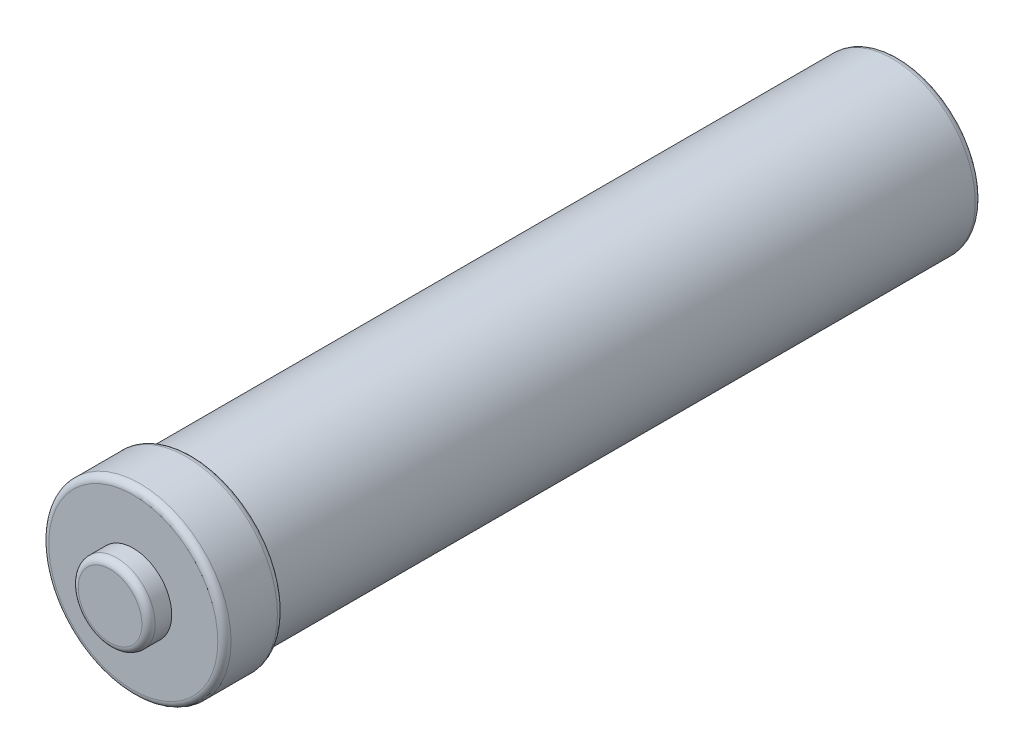
ISO-10303-21;
HEADER;
FILE_DESCRIPTION(('STEP AP214'),'2;1');
FILE_NAME('part.step','',(''),(''),'','','');
FILE_SCHEMA(('AUTOMOTIVE_DESIGN { 1 0 10303 214 1 1 1 1 }'));
ENDSEC;
DATA;
#1=APPLICATION_CONTEXT('core data for automotive mechanical design processes');
#2=APPLICATION_PROTOCOL_DEFINITION('international standard','automotive_design',2000,#1);
#3=PRODUCT_CONTEXT('',#1,'mechanical');
#4=PRODUCT('Part','Part','',(#3));
#5=PRODUCT_RELATED_PRODUCT_CATEGORY('part','',(#4));
#6=PRODUCT_DEFINITION_FORMATION('','',#4);
#7=PRODUCT_DEFINITION_CONTEXT('part definition',#1,'design');
#8=PRODUCT_DEFINITION('design','',#6,#7);
#9=PRODUCT_DEFINITION_SHAPE('','',#8);
#10=(LENGTH_UNIT() NAMED_UNIT(*) SI_UNIT(.MILLI.,.METRE.));
#11=(NAMED_UNIT(*) PLANE_ANGLE_UNIT() SI_UNIT($,.RADIAN.));
#12=(NAMED_UNIT(*) SI_UNIT($,.STERADIAN.) SOLID_ANGLE_UNIT());
#13=UNCERTAINTY_MEASURE_WITH_UNIT(LENGTH_MEASURE(1.E-05),#10,'distance_accuracy_value','');
#14=(GEOMETRIC_REPRESENTATION_CONTEXT(3) GLOBAL_UNCERTAINTY_ASSIGNED_CONTEXT((#13)) GLOBAL_UNIT_ASSIGNED_CONTEXT((#10,
#11,#12)) REPRESENTATION_CONTEXT('',''));
#15=CARTESIAN_POINT('',(0.,0.,0.));
#16=DIRECTION('',(0.,0.,1.));
#17=DIRECTION('',(1.,0.,0.));
#18=AXIS2_PLACEMENT_3D('',#15,#16,#17);
#19=CARTESIAN_POINT('',(0.,0.,8.89));
#20=DIRECTION('',(0.,0.,-1.));
#21=DIRECTION('',(-1.,0.,0.));
#22=AXIS2_PLACEMENT_3D('',#19,#20,#21);
#23=CYLINDRICAL_SURFACE('',#22,14.732);
#24=CARTESIAN_POINT('',(0.,0.,2.54));
#25=DIRECTION('',(0.,0.,1.));
#26=DIRECTION('',(1.,0.,0.));
#27=AXIS2_PLACEMENT_3D('',#24,#25,#26);
#28=CIRCLE('',#27,14.732);
#29=CARTESIAN_POINT('',(14.732,0.,2.54));
#30=VERTEX_POINT('',#29);
#31=EDGE_CURVE('E65',#30,#30,#28,.T.);
#32=ORIENTED_EDGE('',*,*,#31,.T.);
#33=EDGE_LOOP('',(#32));
#34=FACE_BOUND('',#33,.T.);
#35=CARTESIAN_POINT('',(0.,0.,8.89));
#36=DIRECTION('',(0.,0.,1.));
#37=DIRECTION('',(1.,0.,0.));
#38=AXIS2_PLACEMENT_3D('',#35,#36,#37);
#39=CIRCLE('',#38,14.732);
#40=CARTESIAN_POINT('',(14.732,0.,8.89));
#41=VERTEX_POINT('',#40);
#42=EDGE_CURVE('E71',#41,#41,#39,.T.);
#43=ORIENTED_EDGE('',*,*,#42,.F.);
#44=EDGE_LOOP('',(#43));
#45=FACE_BOUND('',#44,.T.);
#46=ADVANCED_FACE('F30',(#34,#45),#23,.T.);
#47=CARTESIAN_POINT('',(0.,0.,0.));
#48=DIRECTION('',(0.,0.,1.));
#49=DIRECTION('',(1.,0.,0.));
#50=AXIS2_PLACEMENT_3D('',#47,#48,#49);
#51=PLANE('',#50);
#52=CARTESIAN_POINT('',(0.,0.,0.));
#53=DIRECTION('',(0.,0.,1.));
#54=DIRECTION('',(1.,0.,0.));
#55=AXIS2_PLACEMENT_3D('',#52,#53,#54);
#56=CIRCLE('',#55,12.192);
#57=CARTESIAN_POINT('',(12.192,0.,0.));
#58=VERTEX_POINT('',#57);
#59=EDGE_CURVE('E62',#58,#58,#56,.F.);
#60=ORIENTED_EDGE('',*,*,#59,.T.);
#61=EDGE_LOOP('',(#60));
#62=FACE_BOUND('',#61,.T.);
#63=ADVANCED_FACE('F92',(#62),#51,.F.);
#64=CARTESIAN_POINT('',(0.,0.,8.89));
#65=DIRECTION('',(0.,0.,1.));
#66=DIRECTION('',(1.,0.,0.));
#67=AXIS2_PLACEMENT_3D('',#64,#65,#66);
#68=PLANE('',#67);
#69=CARTESIAN_POINT('',(0.,0.,8.89));
#70=DIRECTION('',(0.,0.,1.));
#71=DIRECTION('',(1.,0.,0.));
#72=AXIS2_PLACEMENT_3D('',#69,#70,#71);
#73=CIRCLE('',#72,29.21);
#74=CARTESIAN_POINT('',(29.21,0.,8.89));
#75=VERTEX_POINT('',#74);
#76=EDGE_CURVE('E56',#75,#75,#73,.F.);
#77=ORIENTED_EDGE('',*,*,#76,.T.);
#78=EDGE_LOOP('',(#77));
#79=FACE_BOUND('',#78,.T.);
#80=ORIENTED_EDGE('',*,*,#42,.T.);
#81=EDGE_LOOP('',(#80));
#82=FACE_BOUND('',#81,.T.);
#83=ADVANCED_FACE('F82',(#79,#82),#68,.F.);
#84=CARTESIAN_POINT('',(0.,0.,279.4));
#85=DIRECTION('',(0.,0.,-1.));
#86=DIRECTION('',(-1.,0.,0.));
#87=AXIS2_PLACEMENT_3D('',#84,#85,#86);
#88=CYLINDRICAL_SURFACE('',#87,31.75);
#89=CARTESIAN_POINT('',(0.,0.,11.43));
#90=DIRECTION('',(0.,0.,1.));
#91=DIRECTION('',(1.,0.,0.));
#92=AXIS2_PLACEMENT_3D('',#89,#90,#91);
#93=CIRCLE('',#92,31.75);
#94=CARTESIAN_POINT('',(31.75,0.,11.43));
#95=VERTEX_POINT('',#94);
#96=EDGE_CURVE('E59',#95,#95,#93,.T.);
#97=ORIENTED_EDGE('',*,*,#96,.T.);
#98=EDGE_LOOP('',(#97));
#99=FACE_BOUND('',#98,.T.);
#100=CARTESIAN_POINT('',(0.,0.,279.4));
#101=DIRECTION('',(0.,0.,1.));
#102=DIRECTION('',(1.,0.,0.));
#103=AXIS2_PLACEMENT_3D('',#100,#101,#102);
#104=CIRCLE('',#103,31.75);
#105=CARTESIAN_POINT('',(31.75,0.,279.4));
#106=VERTEX_POINT('',#105);
#107=EDGE_CURVE('E74',#106,#106,#104,.T.);
#108=ORIENTED_EDGE('',*,*,#107,.F.);
#109=EDGE_LOOP('',(#108));
#110=FACE_BOUND('',#109,.T.);
#111=ADVANCED_FACE('F80',(#99,#110),#88,.T.);
#112=CARTESIAN_POINT('',(0.,0.,279.4));
#113=DIRECTION('',(0.,0.,1.));
#114=DIRECTION('',(1.,0.,0.));
#115=AXIS2_PLACEMENT_3D('',#112,#113,#114);
#116=PLANE('',#115);
#117=CARTESIAN_POINT('',(0.,0.,279.4));
#118=DIRECTION('',(0.,0.,1.));
#119=DIRECTION('',(1.,0.,0.));
#120=AXIS2_PLACEMENT_3D('',#117,#118,#119);
#121=CIRCLE('',#120,32.385);
#122=CARTESIAN_POINT('',(32.385,0.,279.4));
#123=VERTEX_POINT('',#122);
#124=EDGE_CURVE('E45',#123,#123,#121,.F.);
#125=ORIENTED_EDGE('',*,*,#124,.T.);
#126=EDGE_LOOP('',(#125));
#127=FACE_BOUND('',#126,.T.);
#128=ORIENTED_EDGE('',*,*,#107,.T.);
#129=EDGE_LOOP('',(#128));
#130=FACE_BOUND('',#129,.T.);
#131=ADVANCED_FACE('F78',(#127,#130),#116,.F.);
#132=CARTESIAN_POINT('',(0.,0.,302.26));
#133=DIRECTION('',(0.,0.,-1.));
#134=DIRECTION('',(-1.,0.,0.));
#135=AXIS2_PLACEMENT_3D('',#132,#133,#134);
#136=CYLINDRICAL_SURFACE('',#135,34.925);
#137=CARTESIAN_POINT('',(0.,0.,281.94));
#138=DIRECTION('',(0.,0.,1.));
#139=DIRECTION('',(1.,0.,0.));
#140=AXIS2_PLACEMENT_3D('',#137,#138,#139);
#141=CIRCLE('',#140,34.925);
#142=CARTESIAN_POINT('',(34.925,0.,281.94));
#143=VERTEX_POINT('',#142);
#144=EDGE_CURVE('E50',#143,#143,#141,.T.);
#145=ORIENTED_EDGE('',*,*,#144,.T.);
#146=EDGE_LOOP('',(#145));
#147=FACE_BOUND('',#146,.T.);
#148=CARTESIAN_POINT('',(0.,0.,299.72));
#149=DIRECTION('',(0.,0.,1.));
#150=DIRECTION('',(1.,0.,0.));
#151=AXIS2_PLACEMENT_3D('',#148,#149,#150);
#152=CIRCLE('',#151,34.925);
#153=CARTESIAN_POINT('',(34.925,0.,299.72));
#154=VERTEX_POINT('',#153);
#155=EDGE_CURVE('E53',#154,#154,#152,.F.);
#156=ORIENTED_EDGE('',*,*,#155,.T.);
#157=EDGE_LOOP('',(#156));
#158=FACE_BOUND('',#157,.T.);
#159=ADVANCED_FACE('F89',(#147,#158),#136,.T.);
#160=CARTESIAN_POINT('',(0.,0.,302.26));
#161=DIRECTION('',(0.,0.,1.));
#162=DIRECTION('',(1.,0.,0.));
#163=AXIS2_PLACEMENT_3D('',#160,#161,#162);
#164=PLANE('',#163);
#165=CARTESIAN_POINT('',(0.,0.,302.26));
#166=DIRECTION('',(0.,0.,1.));
#167=DIRECTION('',(1.,0.,0.));
#168=AXIS2_PLACEMENT_3D('',#165,#166,#167);
#169=CIRCLE('',#168,32.385);
#170=CARTESIAN_POINT('',(32.385,0.,302.26));
#171=VERTEX_POINT('',#170);
#172=EDGE_CURVE('E41',#171,#171,#169,.T.);
#173=ORIENTED_EDGE('',*,*,#172,.T.);
#174=EDGE_LOOP('',(#173));
#175=FACE_BOUND('',#174,.T.);
#176=CARTESIAN_POINT('',(0.,0.,302.26));
#177=DIRECTION('',(0.,0.,1.));
#178=DIRECTION('',(1.,0.,0.));
#179=AXIS2_PLACEMENT_3D('',#176,#177,#178);
#180=CIRCLE('',#179,14.732);
#181=CARTESIAN_POINT('',(14.732,0.,302.26));
#182=VERTEX_POINT('',#181);
#183=EDGE_CURVE('E68',#182,#182,#180,.T.);
#184=ORIENTED_EDGE('',*,*,#183,.F.);
#185=EDGE_LOOP('',(#184));
#186=FACE_BOUND('',#185,.T.);
#187=ADVANCED_FACE('F128',(#175,#186),#164,.T.);
#188=CARTESIAN_POINT('',(0.,0.,302.26));
#189=DIRECTION('',(0.,0.,1.));
#190=DIRECTION('',(1.,0.,0.));
#191=AXIS2_PLACEMENT_3D('',#188,#189,#190);
#192=CYLINDRICAL_SURFACE('',#191,14.732);
#193=CARTESIAN_POINT('',(0.,0.,308.61));
#194=DIRECTION('',(0.,0.,-1.));
#195=DIRECTION('',(-1.,0.,0.));
#196=AXIS2_PLACEMENT_3D('',#193,#194,#195);
#197=CIRCLE('',#196,14.732);
#198=CARTESIAN_POINT('',(-14.732,0.,308.61));
#199=VERTEX_POINT('',#198);
#200=EDGE_CURVE('E10',#199,#199,#197,.T.);
#201=ORIENTED_EDGE('',*,*,#200,.T.);
#202=EDGE_LOOP('',(#201));
#203=FACE_BOUND('',#202,.T.);
#204=ORIENTED_EDGE('',*,*,#183,.T.);
#205=EDGE_LOOP('',(#204));
#206=FACE_BOUND('',#205,.T.);
#207=ADVANCED_FACE('F131',(#203,#206),#192,.T.);
#208=CARTESIAN_POINT('',(0.,0.,311.15));
#209=DIRECTION('',(0.,0.,-1.));
#210=DIRECTION('',(1.,0.,0.));
#211=AXIS2_PLACEMENT_3D('',#208,#209,#210);
#212=PLANE('',#211);
#213=CARTESIAN_POINT('',(0.,0.,311.15));
#214=DIRECTION('',(0.,0.,-1.));
#215=DIRECTION('',(-1.,0.,0.));
#216=AXIS2_PLACEMENT_3D('',#213,#214,#215);
#217=CIRCLE('',#216,12.192);
#218=CARTESIAN_POINT('',(-12.192,0.,311.15));
#219=VERTEX_POINT('',#218);
#220=EDGE_CURVE('E37',#219,#219,#217,.F.);
#221=ORIENTED_EDGE('',*,*,#220,.T.);
#222=EDGE_LOOP('',(#221));
#223=FACE_BOUND('',#222,.T.);
#224=ADVANCED_FACE('F109',(#223),#212,.F.);
#225=CARTESIAN_POINT('',(0.,0.,2.54));
#226=DIRECTION('',(0.,0.,1.));
#227=DIRECTION('',(1.,0.,0.));
#228=AXIS2_PLACEMENT_3D('',#225,#226,#227);
#229=TOROIDAL_SURFACE('',#228,12.192,2.54);
#230=ORIENTED_EDGE('',*,*,#59,.F.);
#231=EDGE_LOOP('',(#230));
#232=FACE_BOUND('',#231,.T.);
#233=ORIENTED_EDGE('',*,*,#31,.F.);
#234=EDGE_LOOP('',(#233));
#235=FACE_BOUND('',#234,.T.);
#236=ADVANCED_FACE('F105',(#232,#235),#229,.T.);
#237=CARTESIAN_POINT('',(0.,0.,11.43));
#238=DIRECTION('',(0.,0.,1.));
#239=DIRECTION('',(1.,0.,0.));
#240=AXIS2_PLACEMENT_3D('',#237,#238,#239);
#241=TOROIDAL_SURFACE('',#240,29.21,2.54);
#242=ORIENTED_EDGE('',*,*,#76,.F.);
#243=EDGE_LOOP('',(#242));
#244=FACE_BOUND('',#243,.T.);
#245=ORIENTED_EDGE('',*,*,#96,.F.);
#246=EDGE_LOOP('',(#245));
#247=FACE_BOUND('',#246,.T.);
#248=ADVANCED_FACE('F108',(#244,#247),#241,.T.);
#249=CARTESIAN_POINT('',(0.,0.,281.94));
#250=DIRECTION('',(0.,0.,1.));
#251=DIRECTION('',(1.,0.,0.));
#252=AXIS2_PLACEMENT_3D('',#249,#250,#251);
#253=TOROIDAL_SURFACE('',#252,32.385,2.54);
#254=ORIENTED_EDGE('',*,*,#124,.F.);
#255=EDGE_LOOP('',(#254));
#256=FACE_BOUND('',#255,.T.);
#257=ORIENTED_EDGE('',*,*,#144,.F.);
#258=EDGE_LOOP('',(#257));
#259=FACE_BOUND('',#258,.T.);
#260=ADVANCED_FACE('F113',(#256,#259),#253,.T.);
#261=CARTESIAN_POINT('',(0.,0.,299.72));
#262=DIRECTION('',(0.,0.,1.));
#263=DIRECTION('',(1.,0.,0.));
#264=AXIS2_PLACEMENT_3D('',#261,#262,#263);
#265=TOROIDAL_SURFACE('',#264,32.385,2.54);
#266=ORIENTED_EDGE('',*,*,#155,.F.);
#267=EDGE_LOOP('',(#266));
#268=FACE_BOUND('',#267,.T.);
#269=ORIENTED_EDGE('',*,*,#172,.F.);
#270=EDGE_LOOP('',(#269));
#271=FACE_BOUND('',#270,.T.);
#272=ADVANCED_FACE('F116',(#268,#271),#265,.T.);
#273=CARTESIAN_POINT('',(0.,0.,308.61));
#274=DIRECTION('',(0.,0.,-1.));
#275=DIRECTION('',(-1.,0.,0.));
#276=AXIS2_PLACEMENT_3D('',#273,#274,#275);
#277=TOROIDAL_SURFACE('',#276,12.192,2.54);
#278=ORIENTED_EDGE('',*,*,#200,.F.);
#279=EDGE_LOOP('',(#278));
#280=FACE_BOUND('',#279,.T.);
#281=ORIENTED_EDGE('',*,*,#220,.F.);
#282=EDGE_LOOP('',(#281));
#283=FACE_BOUND('',#282,.T.);
#284=ADVANCED_FACE('F32',(#280,#283),#277,.T.);
#285=CLOSED_SHELL('',(#46,#63,#83,#111,#131,#159,#187,#207,#224,#236,#248,#260,#272,#284));
#286=MANIFOLD_SOLID_BREP('B2',#285);
#287=ADVANCED_BREP_SHAPE_REPRESENTATION('',(#18,#286),#14);
#288=SHAPE_DEFINITION_REPRESENTATION(#9,#287);
ENDSEC;
END-ISO-10303-21;
